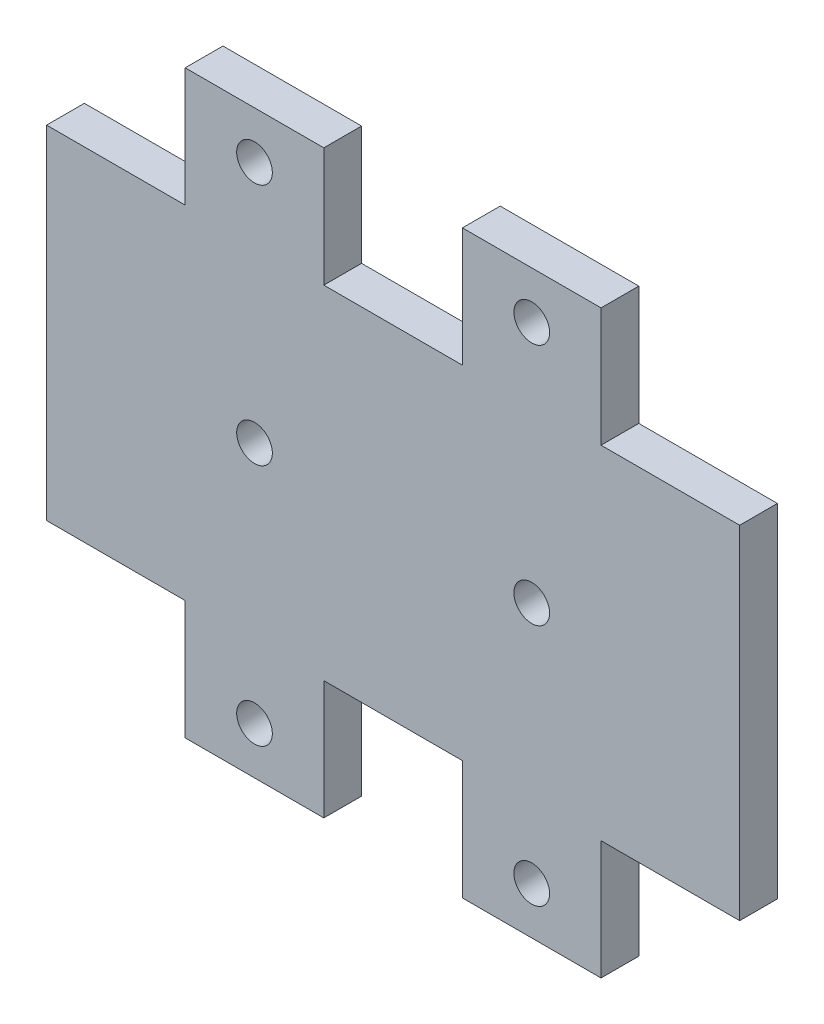
ISO-10303-21;
HEADER;
FILE_DESCRIPTION(('STEP AP214'),'2;1');
FILE_NAME('part.step','',(''),(''),'','','');
FILE_SCHEMA(('AUTOMOTIVE_DESIGN { 1 0 10303 214 1 1 1 1 }'));
ENDSEC;
DATA;
#1=APPLICATION_CONTEXT('core data for automotive mechanical design processes');
#2=APPLICATION_PROTOCOL_DEFINITION('international standard','automotive_design',2000,#1);
#3=PRODUCT_CONTEXT('',#1,'mechanical');
#4=PRODUCT('Part','Part','',(#3));
#5=PRODUCT_RELATED_PRODUCT_CATEGORY('part','',(#4));
#6=PRODUCT_DEFINITION_FORMATION('','',#4);
#7=PRODUCT_DEFINITION_CONTEXT('part definition',#1,'design');
#8=PRODUCT_DEFINITION('design','',#6,#7);
#9=PRODUCT_DEFINITION_SHAPE('','',#8);
#10=(LENGTH_UNIT() NAMED_UNIT(*) SI_UNIT(.MILLI.,.METRE.));
#11=(NAMED_UNIT(*) PLANE_ANGLE_UNIT() SI_UNIT($,.RADIAN.));
#12=(NAMED_UNIT(*) SI_UNIT($,.STERADIAN.) SOLID_ANGLE_UNIT());
#13=UNCERTAINTY_MEASURE_WITH_UNIT(LENGTH_MEASURE(1.E-05),#10,'distance_accuracy_value','');
#14=(GEOMETRIC_REPRESENTATION_CONTEXT(3) GLOBAL_UNCERTAINTY_ASSIGNED_CONTEXT((#13)) GLOBAL_UNIT_ASSIGNED_CONTEXT((#10,
#11,#12)) REPRESENTATION_CONTEXT('',''));
#15=CARTESIAN_POINT('',(0.,0.,0.));
#16=DIRECTION('',(0.,0.,1.));
#17=DIRECTION('',(1.,0.,0.));
#18=AXIS2_PLACEMENT_3D('',#15,#16,#17);
#19=CARTESIAN_POINT('',(17.485,0.,3.175));
#20=DIRECTION('',(0.,0.,1.));
#21=DIRECTION('',(1.,0.,0.));
#22=AXIS2_PLACEMENT_3D('',#19,#20,#21);
#23=PLANE('',#22);
#24=CARTESIAN_POINT('',(17.485,0.,3.175));
#25=DIRECTION('',(0.,0.,-1.));
#26=DIRECTION('',(1.,0.,0.));
#27=AXIS2_PLACEMENT_3D('',#24,#25,#26);
#28=CIRCLE('',#27,1.5);
#29=CARTESIAN_POINT('',(18.985,0.,3.175));
#30=VERTEX_POINT('',#29);
#31=EDGE_CURVE('E407',#30,#30,#28,.T.);
#32=ORIENTED_EDGE('',*,*,#31,.T.);
#33=EDGE_LOOP('',(#32));
#34=FACE_BOUND('',#33,.T.);
#35=DIRECTION('',(-1.,0.,0.));
#36=VECTOR('',#35,1.);
#37=CARTESIAN_POINT('',(0.,14.4,3.175));
#38=LINE('',#37,#36);
#39=CARTESIAN_POINT('',(11.656,14.4,3.175));
#40=VERTEX_POINT('',#39);
#41=CARTESIAN_POINT('',(0.,14.4,3.175));
#42=VERTEX_POINT('',#41);
#43=EDGE_CURVE('E136',#40,#42,#38,.T.);
#44=ORIENTED_EDGE('',*,*,#43,.T.);
#45=DIRECTION('',(0.,-1.,0.));
#46=VECTOR('',#45,1.);
#47=CARTESIAN_POINT('',(0.,0.,3.175));
#48=LINE('',#47,#46);
#49=CARTESIAN_POINT('',(0.,-14.4,3.175));
#50=VERTEX_POINT('',#49);
#51=EDGE_CURVE('E89',#42,#50,#48,.T.);
#52=ORIENTED_EDGE('',*,*,#51,.T.);
#53=DIRECTION('',(-1.,0.,0.));
#54=VECTOR('',#53,1.);
#55=CARTESIAN_POINT('',(0.,-14.4,3.175));
#56=LINE('',#55,#54);
#57=CARTESIAN_POINT('',(11.656,-14.4,3.175));
#58=VERTEX_POINT('',#57);
#59=EDGE_CURVE('E357',#58,#50,#56,.T.);
#60=ORIENTED_EDGE('',*,*,#59,.F.);
#61=DIRECTION('',(0.,1.,0.));
#62=VECTOR('',#61,1.);
#63=CARTESIAN_POINT('',(11.656,-14.4,3.175));
#64=LINE('',#63,#62);
#65=CARTESIAN_POINT('',(11.656,-24.4,3.175));
#66=VERTEX_POINT('',#65);
#67=EDGE_CURVE('E370',#66,#58,#64,.T.);
#68=ORIENTED_EDGE('',*,*,#67,.F.);
#69=DIRECTION('',(-1.,0.,0.));
#70=VECTOR('',#69,1.);
#71=CARTESIAN_POINT('',(11.656,-24.4,3.175));
#72=LINE('',#71,#70);
#73=CARTESIAN_POINT('',(23.312,-24.4,3.175));
#74=VERTEX_POINT('',#73);
#75=EDGE_CURVE('E367',#74,#66,#72,.T.);
#76=ORIENTED_EDGE('',*,*,#75,.F.);
#77=DIRECTION('',(0.,-1.,0.));
#78=VECTOR('',#77,1.);
#79=CARTESIAN_POINT('',(23.312,-14.4,3.175));
#80=LINE('',#79,#78);
#81=CARTESIAN_POINT('',(23.312,-14.4,3.175));
#82=VERTEX_POINT('',#81);
#83=EDGE_CURVE('E364',#82,#74,#80,.T.);
#84=ORIENTED_EDGE('',*,*,#83,.F.);
#85=DIRECTION('',(-1.,0.,0.));
#86=VECTOR('',#85,1.);
#87=CARTESIAN_POINT('',(23.312,-14.4,3.175));
#88=LINE('',#87,#86);
#89=CARTESIAN_POINT('',(34.968,-14.4,3.175));
#90=VERTEX_POINT('',#89);
#91=EDGE_CURVE('E360',#90,#82,#88,.T.);
#92=ORIENTED_EDGE('',*,*,#91,.F.);
#93=DIRECTION('',(0.,-1.,0.));
#94=VECTOR('',#93,1.);
#95=CARTESIAN_POINT('',(34.968,-14.4,3.175));
#96=LINE('',#95,#94);
#97=CARTESIAN_POINT('',(34.968,-24.4,3.175));
#98=VERTEX_POINT('',#97);
#99=EDGE_CURVE('E260',#90,#98,#96,.T.);
#100=ORIENTED_EDGE('',*,*,#99,.T.);
#101=DIRECTION('',(1.,0.,0.));
#102=VECTOR('',#101,1.);
#103=CARTESIAN_POINT('',(46.624,-24.4,3.175));
#104=LINE('',#103,#102);
#105=CARTESIAN_POINT('',(46.624,-24.4,3.175));
#106=VERTEX_POINT('',#105);
#107=EDGE_CURVE('E264',#98,#106,#104,.T.);
#108=ORIENTED_EDGE('',*,*,#107,.T.);
#109=DIRECTION('',(0.,1.,0.));
#110=VECTOR('',#109,1.);
#111=CARTESIAN_POINT('',(46.624,-14.4,3.175));
#112=LINE('',#111,#110);
#113=CARTESIAN_POINT('',(46.624,-14.4,3.175));
#114=VERTEX_POINT('',#113);
#115=EDGE_CURVE('E267',#106,#114,#112,.T.);
#116=ORIENTED_EDGE('',*,*,#115,.T.);
#117=DIRECTION('',(1.,0.,0.));
#118=VECTOR('',#117,1.);
#119=CARTESIAN_POINT('',(58.28,-14.4,3.175));
#120=LINE('',#119,#118);
#121=CARTESIAN_POINT('',(58.28,-14.4,3.175));
#122=VERTEX_POINT('',#121);
#123=EDGE_CURVE('E257',#114,#122,#120,.T.);
#124=ORIENTED_EDGE('',*,*,#123,.T.);
#125=DIRECTION('',(0.,-1.,0.));
#126=VECTOR('',#125,1.);
#127=CARTESIAN_POINT('',(58.28,0.,3.175));
#128=LINE('',#127,#126);
#129=CARTESIAN_POINT('',(58.28,14.4,3.175));
#130=VERTEX_POINT('',#129);
#131=EDGE_CURVE('E305',#130,#122,#128,.T.);
#132=ORIENTED_EDGE('',*,*,#131,.F.);
#133=DIRECTION('',(1.,0.,0.));
#134=VECTOR('',#133,1.);
#135=CARTESIAN_POINT('',(58.28,14.4,3.175));
#136=LINE('',#135,#134);
#137=CARTESIAN_POINT('',(46.624,14.4,3.175));
#138=VERTEX_POINT('',#137);
#139=EDGE_CURVE('E302',#138,#130,#136,.T.);
#140=ORIENTED_EDGE('',*,*,#139,.F.);
#141=DIRECTION('',(0.,-1.,0.));
#142=VECTOR('',#141,1.);
#143=CARTESIAN_POINT('',(46.624,14.4,3.175));
#144=LINE('',#143,#142);
#145=CARTESIAN_POINT('',(46.624,24.4,3.175));
#146=VERTEX_POINT('',#145);
#147=EDGE_CURVE('E318',#146,#138,#144,.T.);
#148=ORIENTED_EDGE('',*,*,#147,.F.);
#149=DIRECTION('',(1.,0.,0.));
#150=VECTOR('',#149,1.);
#151=CARTESIAN_POINT('',(46.624,24.4,3.175));
#152=LINE('',#151,#150);
#153=CARTESIAN_POINT('',(34.968,24.4,3.175));
#154=VERTEX_POINT('',#153);
#155=EDGE_CURVE('E315',#154,#146,#152,.T.);
#156=ORIENTED_EDGE('',*,*,#155,.F.);
#157=DIRECTION('',(0.,1.,0.));
#158=VECTOR('',#157,1.);
#159=CARTESIAN_POINT('',(34.968,14.4,3.175));
#160=LINE('',#159,#158);
#161=CARTESIAN_POINT('',(34.968,14.4,3.175));
#162=VERTEX_POINT('',#161);
#163=EDGE_CURVE('E312',#162,#154,#160,.T.);
#164=ORIENTED_EDGE('',*,*,#163,.F.);
#165=DIRECTION('',(-1.,0.,0.));
#166=VECTOR('',#165,1.);
#167=CARTESIAN_POINT('',(23.312,14.4,3.175));
#168=LINE('',#167,#166);
#169=CARTESIAN_POINT('',(23.312,14.4,3.175));
#170=VERTEX_POINT('',#169);
#171=EDGE_CURVE('E104',#162,#170,#168,.T.);
#172=ORIENTED_EDGE('',*,*,#171,.T.);
#173=DIRECTION('',(0.,1.,0.));
#174=VECTOR('',#173,1.);
#175=CARTESIAN_POINT('',(23.312,14.4,3.175));
#176=LINE('',#175,#174);
#177=CARTESIAN_POINT('',(23.312,24.4,3.175));
#178=VERTEX_POINT('',#177);
#179=EDGE_CURVE('E97',#170,#178,#176,.T.);
#180=ORIENTED_EDGE('',*,*,#179,.T.);
#181=DIRECTION('',(-1.,0.,0.));
#182=VECTOR('',#181,1.);
#183=CARTESIAN_POINT('',(11.656,24.4,3.175));
#184=LINE('',#183,#182);
#185=CARTESIAN_POINT('',(11.656,24.4,3.175));
#186=VERTEX_POINT('',#185);
#187=EDGE_CURVE('E101',#178,#186,#184,.T.);
#188=ORIENTED_EDGE('',*,*,#187,.T.);
#189=DIRECTION('',(0.,-1.,0.));
#190=VECTOR('',#189,1.);
#191=CARTESIAN_POINT('',(11.656,14.4,3.175));
#192=LINE('',#191,#190);
#193=EDGE_CURVE('E54',#186,#40,#192,.T.);
#194=ORIENTED_EDGE('',*,*,#193,.T.);
#195=EDGE_LOOP('',(#44,#52,#60,#68,#76,#84,#92,#100,#108,#116,#124,#132,#140,#148,#156,#164,
#172,#180,#188,#194));
#196=FACE_BOUND('',#195,.T.);
#197=CARTESIAN_POINT('',(17.484,20.43125,3.175));
#198=DIRECTION('',(0.,0.,1.));
#199=DIRECTION('',(1.,0.,0.));
#200=AXIS2_PLACEMENT_3D('',#197,#198,#199);
#201=CIRCLE('',#200,1.5);
#202=CARTESIAN_POINT('',(18.984,20.43125,3.175));
#203=VERTEX_POINT('',#202);
#204=EDGE_CURVE('E125',#203,#203,#201,.T.);
#205=ORIENTED_EDGE('',*,*,#204,.F.);
#206=EDGE_LOOP('',(#205));
#207=FACE_BOUND('',#206,.T.);
#208=CARTESIAN_POINT('',(17.484,-20.43125,3.175));
#209=DIRECTION('',(0.,0.,-1.));
#210=DIRECTION('',(1.,0.,0.));
#211=AXIS2_PLACEMENT_3D('',#208,#209,#210);
#212=CIRCLE('',#211,1.5);
#213=CARTESIAN_POINT('',(18.984,-20.43125,3.175));
#214=VERTEX_POINT('',#213);
#215=EDGE_CURVE('E351',#214,#214,#212,.T.);
#216=ORIENTED_EDGE('',*,*,#215,.T.);
#217=EDGE_LOOP('',(#216));
#218=FACE_BOUND('',#217,.T.);
#219=CARTESIAN_POINT('',(40.795,0.,3.175));
#220=DIRECTION('',(0.,0.,1.));
#221=DIRECTION('',(-1.,0.,0.));
#222=AXIS2_PLACEMENT_3D('',#219,#220,#221);
#223=CIRCLE('',#222,1.5);
#224=CARTESIAN_POINT('',(39.295,0.,3.175));
#225=VERTEX_POINT('',#224);
#226=EDGE_CURVE('E309',#225,#225,#223,.T.);
#227=ORIENTED_EDGE('',*,*,#226,.F.);
#228=EDGE_LOOP('',(#227));
#229=FACE_BOUND('',#228,.T.);
#230=CARTESIAN_POINT('',(40.796,20.43125,3.175));
#231=DIRECTION('',(0.,0.,-1.));
#232=DIRECTION('',(-1.,0.,0.));
#233=AXIS2_PLACEMENT_3D('',#230,#231,#232);
#234=CIRCLE('',#233,1.5);
#235=CARTESIAN_POINT('',(39.296,20.43125,3.175));
#236=VERTEX_POINT('',#235);
#237=EDGE_CURVE('E296',#236,#236,#234,.T.);
#238=ORIENTED_EDGE('',*,*,#237,.T.);
#239=EDGE_LOOP('',(#238));
#240=FACE_BOUND('',#239,.T.);
#241=CARTESIAN_POINT('',(40.796,-20.43125,3.175));
#242=DIRECTION('',(0.,0.,1.));
#243=DIRECTION('',(-1.,0.,0.));
#244=AXIS2_PLACEMENT_3D('',#241,#242,#243);
#245=CIRCLE('',#244,1.5);
#246=CARTESIAN_POINT('',(39.296,-20.43125,3.175));
#247=VERTEX_POINT('',#246);
#248=EDGE_CURVE('E248',#247,#247,#245,.T.);
#249=ORIENTED_EDGE('',*,*,#248,.F.);
#250=EDGE_LOOP('',(#249));
#251=FACE_BOUND('',#250,.T.);
#252=ADVANCED_FACE('F37',(#34,#196,#207,#218,#229,#240,#251),#23,.T.);
#253=CARTESIAN_POINT('',(17.485,0.,0.));
#254=DIRECTION('',(0.,0.,1.));
#255=DIRECTION('',(1.,0.,0.));
#256=AXIS2_PLACEMENT_3D('',#253,#254,#255);
#257=PLANE('',#256);
#258=CARTESIAN_POINT('',(17.485,0.,0.));
#259=DIRECTION('',(0.,0.,-1.));
#260=DIRECTION('',(1.,0.,0.));
#261=AXIS2_PLACEMENT_3D('',#258,#259,#260);
#262=CIRCLE('',#261,1.5);
#263=CARTESIAN_POINT('',(18.985,0.,0.));
#264=VERTEX_POINT('',#263);
#265=EDGE_CURVE('E128',#264,#264,#262,.T.);
#266=ORIENTED_EDGE('',*,*,#265,.F.);
#267=EDGE_LOOP('',(#266));
#268=FACE_BOUND('',#267,.T.);
#269=DIRECTION('',(-1.,0.,0.));
#270=VECTOR('',#269,1.);
#271=CARTESIAN_POINT('',(0.,14.4,0.));
#272=LINE('',#271,#270);
#273=CARTESIAN_POINT('',(11.656,14.4,0.));
#274=VERTEX_POINT('',#273);
#275=CARTESIAN_POINT('',(0.,14.4,0.));
#276=VERTEX_POINT('',#275);
#277=EDGE_CURVE('E121',#274,#276,#272,.T.);
#278=ORIENTED_EDGE('',*,*,#277,.F.);
#279=DIRECTION('',(0.,-1.,0.));
#280=VECTOR('',#279,1.);
#281=CARTESIAN_POINT('',(11.656,14.4,0.));
#282=LINE('',#281,#280);
#283=CARTESIAN_POINT('',(11.656,24.4,0.));
#284=VERTEX_POINT('',#283);
#285=EDGE_CURVE('E81',#284,#274,#282,.T.);
#286=ORIENTED_EDGE('',*,*,#285,.F.);
#287=DIRECTION('',(-1.,0.,0.));
#288=VECTOR('',#287,1.);
#289=CARTESIAN_POINT('',(11.656,24.4,0.));
#290=LINE('',#289,#288);
#291=CARTESIAN_POINT('',(23.312,24.4,0.));
#292=VERTEX_POINT('',#291);
#293=EDGE_CURVE('E75',#292,#284,#290,.T.);
#294=ORIENTED_EDGE('',*,*,#293,.F.);
#295=DIRECTION('',(0.,1.,0.));
#296=VECTOR('',#295,1.);
#297=CARTESIAN_POINT('',(23.312,14.4,0.));
#298=LINE('',#297,#296);
#299=CARTESIAN_POINT('',(23.312,14.4,0.));
#300=VERTEX_POINT('',#299);
#301=EDGE_CURVE('E112',#300,#292,#298,.T.);
#302=ORIENTED_EDGE('',*,*,#301,.F.);
#303=DIRECTION('',(-1.,0.,0.));
#304=VECTOR('',#303,1.);
#305=CARTESIAN_POINT('',(23.312,14.4,0.));
#306=LINE('',#305,#304);
#307=CARTESIAN_POINT('',(34.968,14.4,0.));
#308=VERTEX_POINT('',#307);
#309=EDGE_CURVE('E131',#308,#300,#306,.T.);
#310=ORIENTED_EDGE('',*,*,#309,.F.);
#311=DIRECTION('',(0.,1.,0.));
#312=VECTOR('',#311,1.);
#313=CARTESIAN_POINT('',(34.968,14.4,0.));
#314=LINE('',#313,#312);
#315=CARTESIAN_POINT('',(34.968,24.4,0.));
#316=VERTEX_POINT('',#315);
#317=EDGE_CURVE('E330',#308,#316,#314,.T.);
#318=ORIENTED_EDGE('',*,*,#317,.T.);
#319=DIRECTION('',(1.,0.,0.));
#320=VECTOR('',#319,1.);
#321=CARTESIAN_POINT('',(46.624,24.4,0.));
#322=LINE('',#321,#320);
#323=CARTESIAN_POINT('',(46.624,24.4,0.));
#324=VERTEX_POINT('',#323);
#325=EDGE_CURVE('E332',#316,#324,#322,.T.);
#326=ORIENTED_EDGE('',*,*,#325,.T.);
#327=DIRECTION('',(0.,-1.,0.));
#328=VECTOR('',#327,1.);
#329=CARTESIAN_POINT('',(46.624,14.4,0.));
#330=LINE('',#329,#328);
#331=CARTESIAN_POINT('',(46.624,14.4,0.));
#332=VERTEX_POINT('',#331);
#333=EDGE_CURVE('E306',#324,#332,#330,.T.);
#334=ORIENTED_EDGE('',*,*,#333,.T.);
#335=DIRECTION('',(1.,0.,0.));
#336=VECTOR('',#335,1.);
#337=CARTESIAN_POINT('',(58.28,14.4,0.));
#338=LINE('',#337,#336);
#339=CARTESIAN_POINT('',(58.28,14.4,0.));
#340=VERTEX_POINT('',#339);
#341=EDGE_CURVE('E299',#332,#340,#338,.T.);
#342=ORIENTED_EDGE('',*,*,#341,.T.);
#343=DIRECTION('',(0.,-1.,0.));
#344=VECTOR('',#343,1.);
#345=CARTESIAN_POINT('',(58.28,0.,0.));
#346=LINE('',#345,#344);
#347=CARTESIAN_POINT('',(58.28,-14.4,0.));
#348=VERTEX_POINT('',#347);
#349=EDGE_CURVE('E324',#340,#348,#346,.T.);
#350=ORIENTED_EDGE('',*,*,#349,.T.);
#351=DIRECTION('',(1.,0.,0.));
#352=VECTOR('',#351,1.);
#353=CARTESIAN_POINT('',(58.28,-14.4,0.));
#354=LINE('',#353,#352);
#355=CARTESIAN_POINT('',(46.624,-14.4,0.));
#356=VERTEX_POINT('',#355);
#357=EDGE_CURVE('E254',#356,#348,#354,.T.);
#358=ORIENTED_EDGE('',*,*,#357,.F.);
#359=DIRECTION('',(0.,1.,0.));
#360=VECTOR('',#359,1.);
#361=CARTESIAN_POINT('',(46.624,-14.4,0.));
#362=LINE('',#361,#360);
#363=CARTESIAN_POINT('',(46.624,-24.4,0.));
#364=VERTEX_POINT('',#363);
#365=EDGE_CURVE('E261',#364,#356,#362,.T.);
#366=ORIENTED_EDGE('',*,*,#365,.F.);
#367=DIRECTION('',(1.,0.,0.));
#368=VECTOR('',#367,1.);
#369=CARTESIAN_POINT('',(46.624,-24.4,0.));
#370=LINE('',#369,#368);
#371=CARTESIAN_POINT('',(34.968,-24.4,0.));
#372=VERTEX_POINT('',#371);
#373=EDGE_CURVE('E276',#372,#364,#370,.T.);
#374=ORIENTED_EDGE('',*,*,#373,.F.);
#375=DIRECTION('',(0.,-1.,0.));
#376=VECTOR('',#375,1.);
#377=CARTESIAN_POINT('',(34.968,-14.4,0.));
#378=LINE('',#377,#376);
#379=CARTESIAN_POINT('',(34.968,-14.4,0.));
#380=VERTEX_POINT('',#379);
#381=EDGE_CURVE('E273',#380,#372,#378,.T.);
#382=ORIENTED_EDGE('',*,*,#381,.F.);
#383=DIRECTION('',(-1.,0.,0.));
#384=VECTOR('',#383,1.);
#385=CARTESIAN_POINT('',(23.312,-14.4,0.));
#386=LINE('',#385,#384);
#387=CARTESIAN_POINT('',(23.312,-14.4,0.));
#388=VERTEX_POINT('',#387);
#389=EDGE_CURVE('E375',#380,#388,#386,.T.);
#390=ORIENTED_EDGE('',*,*,#389,.T.);
#391=DIRECTION('',(0.,-1.,0.));
#392=VECTOR('',#391,1.);
#393=CARTESIAN_POINT('',(23.312,-14.4,0.));
#394=LINE('',#393,#392);
#395=CARTESIAN_POINT('',(23.312,-24.4,0.));
#396=VERTEX_POINT('',#395);
#397=EDGE_CURVE('E378',#388,#396,#394,.T.);
#398=ORIENTED_EDGE('',*,*,#397,.T.);
#399=DIRECTION('',(-1.,0.,0.));
#400=VECTOR('',#399,1.);
#401=CARTESIAN_POINT('',(11.656,-24.4,0.));
#402=LINE('',#401,#400);
#403=CARTESIAN_POINT('',(11.656,-24.4,0.));
#404=VERTEX_POINT('',#403);
#405=EDGE_CURVE('E381',#396,#404,#402,.T.);
#406=ORIENTED_EDGE('',*,*,#405,.T.);
#407=DIRECTION('',(0.,1.,0.));
#408=VECTOR('',#407,1.);
#409=CARTESIAN_POINT('',(11.656,-14.4,0.));
#410=LINE('',#409,#408);
#411=CARTESIAN_POINT('',(11.656,-14.4,0.));
#412=VERTEX_POINT('',#411);
#413=EDGE_CURVE('E361',#404,#412,#410,.T.);
#414=ORIENTED_EDGE('',*,*,#413,.T.);
#415=DIRECTION('',(-1.,0.,0.));
#416=VECTOR('',#415,1.);
#417=CARTESIAN_POINT('',(0.,-14.4,0.));
#418=LINE('',#417,#416);
#419=CARTESIAN_POINT('',(0.,-14.4,0.));
#420=VERTEX_POINT('',#419);
#421=EDGE_CURVE('E354',#412,#420,#418,.T.);
#422=ORIENTED_EDGE('',*,*,#421,.T.);
#423=DIRECTION('',(0.,-1.,0.));
#424=VECTOR('',#423,1.);
#425=CARTESIAN_POINT('',(0.,0.,0.));
#426=LINE('',#425,#424);
#427=EDGE_CURVE('E124',#276,#420,#426,.T.);
#428=ORIENTED_EDGE('',*,*,#427,.F.);
#429=EDGE_LOOP('',(#278,#286,#294,#302,#310,#318,#326,#334,#342,#350,#358,#366,#374,#382,#390,
#398,#406,#414,#422,#428));
#430=FACE_BOUND('',#429,.T.);
#431=CARTESIAN_POINT('',(17.484,20.43125,0.));
#432=DIRECTION('',(0.,0.,1.));
#433=DIRECTION('',(1.,0.,0.));
#434=AXIS2_PLACEMENT_3D('',#431,#432,#433);
#435=CIRCLE('',#434,1.5);
#436=CARTESIAN_POINT('',(18.984,20.43125,0.));
#437=VERTEX_POINT('',#436);
#438=EDGE_CURVE('E400',#437,#437,#435,.T.);
#439=ORIENTED_EDGE('',*,*,#438,.T.);
#440=EDGE_LOOP('',(#439));
#441=FACE_BOUND('',#440,.T.);
#442=CARTESIAN_POINT('',(17.484,-20.43125,0.));
#443=DIRECTION('',(0.,0.,-1.));
#444=DIRECTION('',(1.,0.,0.));
#445=AXIS2_PLACEMENT_3D('',#442,#443,#444);
#446=CIRCLE('',#445,1.5);
#447=CARTESIAN_POINT('',(18.984,-20.43125,0.));
#448=VERTEX_POINT('',#447);
#449=EDGE_CURVE('E350',#448,#448,#446,.T.);
#450=ORIENTED_EDGE('',*,*,#449,.F.);
#451=EDGE_LOOP('',(#450));
#452=FACE_BOUND('',#451,.T.);
#453=CARTESIAN_POINT('',(40.795,0.,0.));
#454=DIRECTION('',(0.,0.,1.));
#455=DIRECTION('',(-1.,0.,0.));
#456=AXIS2_PLACEMENT_3D('',#453,#454,#455);
#457=CIRCLE('',#456,1.5);
#458=CARTESIAN_POINT('',(39.295,0.,0.));
#459=VERTEX_POINT('',#458);
#460=EDGE_CURVE('E327',#459,#459,#457,.T.);
#461=ORIENTED_EDGE('',*,*,#460,.T.);
#462=EDGE_LOOP('',(#461));
#463=FACE_BOUND('',#462,.T.);
#464=CARTESIAN_POINT('',(40.796,20.43125,0.));
#465=DIRECTION('',(0.,0.,-1.));
#466=DIRECTION('',(-1.,0.,0.));
#467=AXIS2_PLACEMENT_3D('',#464,#465,#466);
#468=CIRCLE('',#467,1.5);
#469=CARTESIAN_POINT('',(39.296,20.43125,0.));
#470=VERTEX_POINT('',#469);
#471=EDGE_CURVE('E295',#470,#470,#468,.T.);
#472=ORIENTED_EDGE('',*,*,#471,.F.);
#473=EDGE_LOOP('',(#472));
#474=FACE_BOUND('',#473,.T.);
#475=CARTESIAN_POINT('',(40.796,-20.43125,0.));
#476=DIRECTION('',(0.,0.,1.));
#477=DIRECTION('',(-1.,0.,0.));
#478=AXIS2_PLACEMENT_3D('',#475,#476,#477);
#479=CIRCLE('',#478,1.5);
#480=CARTESIAN_POINT('',(39.296,-20.43125,0.));
#481=VERTEX_POINT('',#480);
#482=EDGE_CURVE('E251',#481,#481,#479,.T.);
#483=ORIENTED_EDGE('',*,*,#482,.T.);
#484=EDGE_LOOP('',(#483));
#485=FACE_BOUND('',#484,.T.);
#486=ADVANCED_FACE('F142',(#268,#430,#441,#452,#463,#474,#485),#257,.F.);
#487=CARTESIAN_POINT('',(0.,14.4,3.175));
#488=DIRECTION('',(0.,-1.,0.));
#489=DIRECTION('',(1.,0.,0.));
#490=AXIS2_PLACEMENT_3D('',#487,#488,#489);
#491=PLANE('',#490);
#492=ORIENTED_EDGE('',*,*,#277,.T.);
#493=DIRECTION('',(0.,0.,-1.));
#494=VECTOR('',#493,1.);
#495=CARTESIAN_POINT('',(0.,14.4,3.175));
#496=LINE('',#495,#494);
#497=EDGE_CURVE('E11',#42,#276,#496,.T.);
#498=ORIENTED_EDGE('',*,*,#497,.F.);
#499=ORIENTED_EDGE('',*,*,#43,.F.);
#500=DIRECTION('',(0.,0.,-1.));
#501=VECTOR('',#500,1.);
#502=CARTESIAN_POINT('',(11.656,14.4,3.175));
#503=LINE('',#502,#501);
#504=EDGE_CURVE('E117',#40,#274,#503,.T.);
#505=ORIENTED_EDGE('',*,*,#504,.T.);
#506=EDGE_LOOP('',(#492,#498,#499,#505));
#507=FACE_BOUND('',#506,.T.);
#508=ADVANCED_FACE('F39',(#507),#491,.F.);
#509=CARTESIAN_POINT('',(0.,0.,3.175));
#510=DIRECTION('',(1.,0.,0.));
#511=DIRECTION('',(0.,0.,-1.));
#512=AXIS2_PLACEMENT_3D('',#509,#510,#511);
#513=PLANE('',#512);
#514=ORIENTED_EDGE('',*,*,#427,.T.);
#515=DIRECTION('',(0.,0.,-1.));
#516=VECTOR('',#515,1.);
#517=CARTESIAN_POINT('',(0.,-14.4,3.175));
#518=LINE('',#517,#516);
#519=EDGE_CURVE('E397',#50,#420,#518,.T.);
#520=ORIENTED_EDGE('',*,*,#519,.F.);
#521=ORIENTED_EDGE('',*,*,#51,.F.);
#522=ORIENTED_EDGE('',*,*,#497,.T.);
#523=EDGE_LOOP('',(#514,#520,#521,#522));
#524=FACE_BOUND('',#523,.T.);
#525=ADVANCED_FACE('F413',(#524),#513,.F.);
#526=CARTESIAN_POINT('',(17.485,0.,3.175));
#527=DIRECTION('',(0.,0.,-1.));
#528=DIRECTION('',(-1.,0.,0.));
#529=AXIS2_PLACEMENT_3D('',#526,#527,#528);
#530=CYLINDRICAL_SURFACE('',#529,1.5);
#531=ORIENTED_EDGE('',*,*,#265,.T.);
#532=EDGE_LOOP('',(#531));
#533=FACE_BOUND('',#532,.T.);
#534=ORIENTED_EDGE('',*,*,#31,.F.);
#535=EDGE_LOOP('',(#534));
#536=FACE_BOUND('',#535,.T.);
#537=ADVANCED_FACE('F410',(#533,#536),#530,.F.);
#538=CARTESIAN_POINT('',(23.312,14.4,3.175));
#539=DIRECTION('',(0.,-1.,0.));
#540=DIRECTION('',(0.,0.,-1.));
#541=AXIS2_PLACEMENT_3D('',#538,#539,#540);
#542=PLANE('',#541);
#543=ORIENTED_EDGE('',*,*,#309,.T.);
#544=DIRECTION('',(0.,0.,-1.));
#545=VECTOR('',#544,1.);
#546=CARTESIAN_POINT('',(23.312,14.4,3.175));
#547=LINE('',#546,#545);
#548=EDGE_CURVE('E46',#170,#300,#547,.T.);
#549=ORIENTED_EDGE('',*,*,#548,.F.);
#550=ORIENTED_EDGE('',*,*,#171,.F.);
#551=DIRECTION('',(0.,0.,-1.));
#552=VECTOR('',#551,1.);
#553=CARTESIAN_POINT('',(34.968,14.4,3.175));
#554=LINE('',#553,#552);
#555=EDGE_CURVE('E345',#162,#308,#554,.T.);
#556=ORIENTED_EDGE('',*,*,#555,.T.);
#557=EDGE_LOOP('',(#543,#549,#550,#556));
#558=FACE_BOUND('',#557,.T.);
#559=ADVANCED_FACE('F412',(#558),#542,.F.);
#560=CARTESIAN_POINT('',(23.312,14.4,3.175));
#561=DIRECTION('',(-1.,0.,0.));
#562=DIRECTION('',(0.,0.,1.));
#563=AXIS2_PLACEMENT_3D('',#560,#561,#562);
#564=PLANE('',#563);
#565=ORIENTED_EDGE('',*,*,#301,.T.);
#566=DIRECTION('',(0.,0.,-1.));
#567=VECTOR('',#566,1.);
#568=CARTESIAN_POINT('',(23.312,24.4,3.175));
#569=LINE('',#568,#567);
#570=EDGE_CURVE('E109',#178,#292,#569,.T.);
#571=ORIENTED_EDGE('',*,*,#570,.F.);
#572=ORIENTED_EDGE('',*,*,#179,.F.);
#573=ORIENTED_EDGE('',*,*,#548,.T.);
#574=EDGE_LOOP('',(#565,#571,#572,#573));
#575=FACE_BOUND('',#574,.T.);
#576=ADVANCED_FACE('F110',(#575),#564,.F.);
#577=CARTESIAN_POINT('',(11.656,24.4,3.175));
#578=DIRECTION('',(0.,-1.,0.));
#579=DIRECTION('',(0.,0.,-1.));
#580=AXIS2_PLACEMENT_3D('',#577,#578,#579);
#581=PLANE('',#580);
#582=ORIENTED_EDGE('',*,*,#293,.T.);
#583=DIRECTION('',(0.,0.,-1.));
#584=VECTOR('',#583,1.);
#585=CARTESIAN_POINT('',(11.656,24.4,3.175));
#586=LINE('',#585,#584);
#587=EDGE_CURVE('E113',#186,#284,#586,.T.);
#588=ORIENTED_EDGE('',*,*,#587,.F.);
#589=ORIENTED_EDGE('',*,*,#187,.F.);
#590=ORIENTED_EDGE('',*,*,#570,.T.);
#591=EDGE_LOOP('',(#582,#588,#589,#590));
#592=FACE_BOUND('',#591,.T.);
#593=ADVANCED_FACE('F115',(#592),#581,.F.);
#594=CARTESIAN_POINT('',(11.656,14.4,3.175));
#595=DIRECTION('',(1.,0.,0.));
#596=DIRECTION('',(0.,0.,-1.));
#597=AXIS2_PLACEMENT_3D('',#594,#595,#596);
#598=PLANE('',#597);
#599=ORIENTED_EDGE('',*,*,#285,.T.);
#600=ORIENTED_EDGE('',*,*,#504,.F.);
#601=ORIENTED_EDGE('',*,*,#193,.F.);
#602=ORIENTED_EDGE('',*,*,#587,.T.);
#603=EDGE_LOOP('',(#599,#600,#601,#602));
#604=FACE_BOUND('',#603,.T.);
#605=ADVANCED_FACE('F151',(#604),#598,.F.);
#606=CARTESIAN_POINT('',(17.484,20.43125,3.175));
#607=DIRECTION('',(0.,0.,-1.));
#608=DIRECTION('',(-1.,0.,0.));
#609=AXIS2_PLACEMENT_3D('',#606,#607,#608);
#610=CYLINDRICAL_SURFACE('',#609,1.5);
#611=ORIENTED_EDGE('',*,*,#204,.T.);
#612=EDGE_LOOP('',(#611));
#613=FACE_BOUND('',#612,.T.);
#614=ORIENTED_EDGE('',*,*,#438,.F.);
#615=EDGE_LOOP('',(#614));
#616=FACE_BOUND('',#615,.T.);
#617=ADVANCED_FACE('F153',(#613,#616),#610,.F.);
#618=CARTESIAN_POINT('',(0.,-14.4,3.175));
#619=DIRECTION('',(0.,1.,0.));
#620=DIRECTION('',(1.,0.,0.));
#621=AXIS2_PLACEMENT_3D('',#618,#619,#620);
#622=PLANE('',#621);
#623=ORIENTED_EDGE('',*,*,#421,.F.);
#624=DIRECTION('',(0.,0.,-1.));
#625=VECTOR('',#624,1.);
#626=CARTESIAN_POINT('',(11.656,-14.4,3.175));
#627=LINE('',#626,#625);
#628=EDGE_CURVE('E373',#58,#412,#627,.T.);
#629=ORIENTED_EDGE('',*,*,#628,.F.);
#630=ORIENTED_EDGE('',*,*,#59,.T.);
#631=ORIENTED_EDGE('',*,*,#519,.T.);
#632=EDGE_LOOP('',(#623,#629,#630,#631));
#633=FACE_BOUND('',#632,.T.);
#634=ADVANCED_FACE('F159',(#633),#622,.F.);
#635=CARTESIAN_POINT('',(23.312,-14.4,3.175));
#636=DIRECTION('',(0.,1.,0.));
#637=DIRECTION('',(0.,0.,-1.));
#638=AXIS2_PLACEMENT_3D('',#635,#636,#637);
#639=PLANE('',#638);
#640=ORIENTED_EDGE('',*,*,#389,.F.);
#641=DIRECTION('',(0.,0.,-1.));
#642=VECTOR('',#641,1.);
#643=CARTESIAN_POINT('',(34.968,-14.4,3.175));
#644=LINE('',#643,#642);
#645=EDGE_CURVE('E289',#90,#380,#644,.T.);
#646=ORIENTED_EDGE('',*,*,#645,.F.);
#647=ORIENTED_EDGE('',*,*,#91,.T.);
#648=DIRECTION('',(0.,0.,-1.));
#649=VECTOR('',#648,1.);
#650=CARTESIAN_POINT('',(23.312,-14.4,3.175));
#651=LINE('',#650,#649);
#652=EDGE_CURVE('E394',#82,#388,#651,.T.);
#653=ORIENTED_EDGE('',*,*,#652,.T.);
#654=EDGE_LOOP('',(#640,#646,#647,#653));
#655=FACE_BOUND('',#654,.T.);
#656=ADVANCED_FACE('F175',(#655),#639,.F.);
#657=CARTESIAN_POINT('',(23.312,-14.4,3.175));
#658=DIRECTION('',(-1.,0.,0.));
#659=DIRECTION('',(0.,0.,1.));
#660=AXIS2_PLACEMENT_3D('',#657,#658,#659);
#661=PLANE('',#660);
#662=ORIENTED_EDGE('',*,*,#397,.F.);
#663=ORIENTED_EDGE('',*,*,#652,.F.);
#664=ORIENTED_EDGE('',*,*,#83,.T.);
#665=DIRECTION('',(0.,0.,-1.));
#666=VECTOR('',#665,1.);
#667=CARTESIAN_POINT('',(23.312,-24.4,3.175));
#668=LINE('',#667,#666);
#669=EDGE_CURVE('E391',#74,#396,#668,.T.);
#670=ORIENTED_EDGE('',*,*,#669,.T.);
#671=EDGE_LOOP('',(#662,#663,#664,#670));
#672=FACE_BOUND('',#671,.T.);
#673=ADVANCED_FACE('F179',(#672),#661,.F.);
#674=CARTESIAN_POINT('',(11.656,-24.4,3.175));
#675=DIRECTION('',(0.,1.,0.));
#676=DIRECTION('',(0.,0.,-1.));
#677=AXIS2_PLACEMENT_3D('',#674,#675,#676);
#678=PLANE('',#677);
#679=ORIENTED_EDGE('',*,*,#405,.F.);
#680=ORIENTED_EDGE('',*,*,#669,.F.);
#681=ORIENTED_EDGE('',*,*,#75,.T.);
#682=DIRECTION('',(0.,0.,-1.));
#683=VECTOR('',#682,1.);
#684=CARTESIAN_POINT('',(11.656,-24.4,3.175));
#685=LINE('',#684,#683);
#686=EDGE_CURVE('E388',#66,#404,#685,.T.);
#687=ORIENTED_EDGE('',*,*,#686,.T.);
#688=EDGE_LOOP('',(#679,#680,#681,#687));
#689=FACE_BOUND('',#688,.T.);
#690=ADVANCED_FACE('F183',(#689),#678,.F.);
#691=CARTESIAN_POINT('',(11.656,-14.4,3.175));
#692=DIRECTION('',(1.,0.,0.));
#693=DIRECTION('',(0.,0.,-1.));
#694=AXIS2_PLACEMENT_3D('',#691,#692,#693);
#695=PLANE('',#694);
#696=ORIENTED_EDGE('',*,*,#413,.F.);
#697=ORIENTED_EDGE('',*,*,#686,.F.);
#698=ORIENTED_EDGE('',*,*,#67,.T.);
#699=ORIENTED_EDGE('',*,*,#628,.T.);
#700=EDGE_LOOP('',(#696,#697,#698,#699));
#701=FACE_BOUND('',#700,.T.);
#702=ADVANCED_FACE('F187',(#701),#695,.F.);
#703=CARTESIAN_POINT('',(17.484,-20.43125,3.175));
#704=DIRECTION('',(0.,0.,-1.));
#705=DIRECTION('',(-1.,0.,0.));
#706=AXIS2_PLACEMENT_3D('',#703,#704,#705);
#707=CYLINDRICAL_SURFACE('',#706,1.5);
#708=ORIENTED_EDGE('',*,*,#215,.F.);
#709=EDGE_LOOP('',(#708));
#710=FACE_BOUND('',#709,.T.);
#711=ORIENTED_EDGE('',*,*,#449,.T.);
#712=EDGE_LOOP('',(#711));
#713=FACE_BOUND('',#712,.T.);
#714=ADVANCED_FACE('F191',(#710,#713),#707,.F.);
#715=CARTESIAN_POINT('',(58.28,14.4,3.175));
#716=DIRECTION('',(0.,-1.,0.));
#717=DIRECTION('',(-1.,0.,0.));
#718=AXIS2_PLACEMENT_3D('',#715,#716,#717);
#719=PLANE('',#718);
#720=ORIENTED_EDGE('',*,*,#341,.F.);
#721=DIRECTION('',(0.,0.,-1.));
#722=VECTOR('',#721,1.);
#723=CARTESIAN_POINT('',(46.624,14.4,3.175));
#724=LINE('',#723,#722);
#725=EDGE_CURVE('E321',#138,#332,#724,.T.);
#726=ORIENTED_EDGE('',*,*,#725,.F.);
#727=ORIENTED_EDGE('',*,*,#139,.T.);
#728=DIRECTION('',(0.,0.,-1.));
#729=VECTOR('',#728,1.);
#730=CARTESIAN_POINT('',(58.28,14.4,3.175));
#731=LINE('',#730,#729);
#732=EDGE_CURVE('E347',#130,#340,#731,.T.);
#733=ORIENTED_EDGE('',*,*,#732,.T.);
#734=EDGE_LOOP('',(#720,#726,#727,#733));
#735=FACE_BOUND('',#734,.T.);
#736=ADVANCED_FACE('F195',(#735),#719,.F.);
#737=CARTESIAN_POINT('',(58.28,0.,3.175));
#738=DIRECTION('',(-1.,0.,0.));
#739=DIRECTION('',(0.,0.,-1.));
#740=AXIS2_PLACEMENT_3D('',#737,#738,#739);
#741=PLANE('',#740);
#742=ORIENTED_EDGE('',*,*,#349,.F.);
#743=ORIENTED_EDGE('',*,*,#732,.F.);
#744=ORIENTED_EDGE('',*,*,#131,.T.);
#745=DIRECTION('',(0.,0.,-1.));
#746=VECTOR('',#745,1.);
#747=CARTESIAN_POINT('',(58.28,-14.4,3.175));
#748=LINE('',#747,#746);
#749=EDGE_CURVE('E292',#122,#348,#748,.T.);
#750=ORIENTED_EDGE('',*,*,#749,.T.);
#751=EDGE_LOOP('',(#742,#743,#744,#750));
#752=FACE_BOUND('',#751,.T.);
#753=ADVANCED_FACE('F199',(#752),#741,.F.);
#754=CARTESIAN_POINT('',(40.795,0.,3.175));
#755=DIRECTION('',(0.,0.,-1.));
#756=DIRECTION('',(1.,0.,0.));
#757=AXIS2_PLACEMENT_3D('',#754,#755,#756);
#758=CYLINDRICAL_SURFACE('',#757,1.5);
#759=ORIENTED_EDGE('',*,*,#460,.F.);
#760=EDGE_LOOP('',(#759));
#761=FACE_BOUND('',#760,.T.);
#762=ORIENTED_EDGE('',*,*,#226,.T.);
#763=EDGE_LOOP('',(#762));
#764=FACE_BOUND('',#763,.T.);
#765=ADVANCED_FACE('F203',(#761,#764),#758,.F.);
#766=CARTESIAN_POINT('',(34.968,14.4,3.175));
#767=DIRECTION('',(1.,0.,0.));
#768=DIRECTION('',(0.,0.,1.));
#769=AXIS2_PLACEMENT_3D('',#766,#767,#768);
#770=PLANE('',#769);
#771=ORIENTED_EDGE('',*,*,#317,.F.);
#772=ORIENTED_EDGE('',*,*,#555,.F.);
#773=ORIENTED_EDGE('',*,*,#163,.T.);
#774=DIRECTION('',(0.,0.,-1.));
#775=VECTOR('',#774,1.);
#776=CARTESIAN_POINT('',(34.968,24.4,3.175));
#777=LINE('',#776,#775);
#778=EDGE_CURVE('E342',#154,#316,#777,.T.);
#779=ORIENTED_EDGE('',*,*,#778,.T.);
#780=EDGE_LOOP('',(#771,#772,#773,#779));
#781=FACE_BOUND('',#780,.T.);
#782=ADVANCED_FACE('F207',(#781),#770,.F.);
#783=CARTESIAN_POINT('',(46.624,24.4,3.175));
#784=DIRECTION('',(0.,-1.,0.));
#785=DIRECTION('',(0.,0.,-1.));
#786=AXIS2_PLACEMENT_3D('',#783,#784,#785);
#787=PLANE('',#786);
#788=ORIENTED_EDGE('',*,*,#325,.F.);
#789=ORIENTED_EDGE('',*,*,#778,.F.);
#790=ORIENTED_EDGE('',*,*,#155,.T.);
#791=DIRECTION('',(0.,0.,-1.));
#792=VECTOR('',#791,1.);
#793=CARTESIAN_POINT('',(46.624,24.4,3.175));
#794=LINE('',#793,#792);
#795=EDGE_CURVE('E339',#146,#324,#794,.T.);
#796=ORIENTED_EDGE('',*,*,#795,.T.);
#797=EDGE_LOOP('',(#788,#789,#790,#796));
#798=FACE_BOUND('',#797,.T.);
#799=ADVANCED_FACE('F211',(#798),#787,.F.);
#800=CARTESIAN_POINT('',(46.624,14.4,3.175));
#801=DIRECTION('',(-1.,0.,0.));
#802=DIRECTION('',(0.,0.,-1.));
#803=AXIS2_PLACEMENT_3D('',#800,#801,#802);
#804=PLANE('',#803);
#805=ORIENTED_EDGE('',*,*,#333,.F.);
#806=ORIENTED_EDGE('',*,*,#795,.F.);
#807=ORIENTED_EDGE('',*,*,#147,.T.);
#808=ORIENTED_EDGE('',*,*,#725,.T.);
#809=EDGE_LOOP('',(#805,#806,#807,#808));
#810=FACE_BOUND('',#809,.T.);
#811=ADVANCED_FACE('F215',(#810),#804,.F.);
#812=CARTESIAN_POINT('',(40.796,20.43125,3.175));
#813=DIRECTION('',(0.,0.,-1.));
#814=DIRECTION('',(1.,0.,0.));
#815=AXIS2_PLACEMENT_3D('',#812,#813,#814);
#816=CYLINDRICAL_SURFACE('',#815,1.5);
#817=ORIENTED_EDGE('',*,*,#237,.F.);
#818=EDGE_LOOP('',(#817));
#819=FACE_BOUND('',#818,.T.);
#820=ORIENTED_EDGE('',*,*,#471,.T.);
#821=EDGE_LOOP('',(#820));
#822=FACE_BOUND('',#821,.T.);
#823=ADVANCED_FACE('F219',(#819,#822),#816,.F.);
#824=CARTESIAN_POINT('',(58.28,-14.4,3.175));
#825=DIRECTION('',(0.,1.,0.));
#826=DIRECTION('',(-1.,0.,0.));
#827=AXIS2_PLACEMENT_3D('',#824,#825,#826);
#828=PLANE('',#827);
#829=ORIENTED_EDGE('',*,*,#357,.T.);
#830=ORIENTED_EDGE('',*,*,#749,.F.);
#831=ORIENTED_EDGE('',*,*,#123,.F.);
#832=DIRECTION('',(0.,0.,-1.));
#833=VECTOR('',#832,1.);
#834=CARTESIAN_POINT('',(46.624,-14.4,3.175));
#835=LINE('',#834,#833);
#836=EDGE_CURVE('E270',#114,#356,#835,.T.);
#837=ORIENTED_EDGE('',*,*,#836,.T.);
#838=EDGE_LOOP('',(#829,#830,#831,#837));
#839=FACE_BOUND('',#838,.T.);
#840=ADVANCED_FACE('F223',(#839),#828,.F.);
#841=CARTESIAN_POINT('',(34.968,-14.4,3.175));
#842=DIRECTION('',(1.,0.,0.));
#843=DIRECTION('',(0.,0.,1.));
#844=AXIS2_PLACEMENT_3D('',#841,#842,#843);
#845=PLANE('',#844);
#846=ORIENTED_EDGE('',*,*,#381,.T.);
#847=DIRECTION('',(0.,0.,-1.));
#848=VECTOR('',#847,1.);
#849=CARTESIAN_POINT('',(34.968,-24.4,3.175));
#850=LINE('',#849,#848);
#851=EDGE_CURVE('E286',#98,#372,#850,.T.);
#852=ORIENTED_EDGE('',*,*,#851,.F.);
#853=ORIENTED_EDGE('',*,*,#99,.F.);
#854=ORIENTED_EDGE('',*,*,#645,.T.);
#855=EDGE_LOOP('',(#846,#852,#853,#854));
#856=FACE_BOUND('',#855,.T.);
#857=ADVANCED_FACE('F227',(#856),#845,.F.);
#858=CARTESIAN_POINT('',(46.624,-24.4,3.175));
#859=DIRECTION('',(0.,1.,0.));
#860=DIRECTION('',(0.,0.,-1.));
#861=AXIS2_PLACEMENT_3D('',#858,#859,#860);
#862=PLANE('',#861);
#863=ORIENTED_EDGE('',*,*,#373,.T.);
#864=DIRECTION('',(0.,0.,-1.));
#865=VECTOR('',#864,1.);
#866=CARTESIAN_POINT('',(46.624,-24.4,3.175));
#867=LINE('',#866,#865);
#868=EDGE_CURVE('E283',#106,#364,#867,.T.);
#869=ORIENTED_EDGE('',*,*,#868,.F.);
#870=ORIENTED_EDGE('',*,*,#107,.F.);
#871=ORIENTED_EDGE('',*,*,#851,.T.);
#872=EDGE_LOOP('',(#863,#869,#870,#871));
#873=FACE_BOUND('',#872,.T.);
#874=ADVANCED_FACE('F231',(#873),#862,.F.);
#875=CARTESIAN_POINT('',(46.624,-14.4,3.175));
#876=DIRECTION('',(-1.,0.,0.));
#877=DIRECTION('',(0.,0.,-1.));
#878=AXIS2_PLACEMENT_3D('',#875,#876,#877);
#879=PLANE('',#878);
#880=ORIENTED_EDGE('',*,*,#365,.T.);
#881=ORIENTED_EDGE('',*,*,#836,.F.);
#882=ORIENTED_EDGE('',*,*,#115,.F.);
#883=ORIENTED_EDGE('',*,*,#868,.T.);
#884=EDGE_LOOP('',(#880,#881,#882,#883));
#885=FACE_BOUND('',#884,.T.);
#886=ADVANCED_FACE('F235',(#885),#879,.F.);
#887=CARTESIAN_POINT('',(40.796,-20.43125,3.175));
#888=DIRECTION('',(0.,0.,-1.));
#889=DIRECTION('',(1.,0.,0.));
#890=AXIS2_PLACEMENT_3D('',#887,#888,#889);
#891=CYLINDRICAL_SURFACE('',#890,1.5);
#892=ORIENTED_EDGE('',*,*,#248,.T.);
#893=EDGE_LOOP('',(#892));
#894=FACE_BOUND('',#893,.T.);
#895=ORIENTED_EDGE('',*,*,#482,.F.);
#896=EDGE_LOOP('',(#895));
#897=FACE_BOUND('',#896,.T.);
#898=ADVANCED_FACE('F239',(#894,#897),#891,.F.);
#899=CLOSED_SHELL('',(#252,#486,#508,#525,#537,#559,#576,#593,#605,#617,#634,#656,#673,#690,
#702,#714,#736,#753,#765,#782,#799,#811,#823,#840,#857,#874,#886,#898));
#900=MANIFOLD_SOLID_BREP('B2',#899);
#901=ADVANCED_BREP_SHAPE_REPRESENTATION('',(#18,#900),#14);
#902=SHAPE_DEFINITION_REPRESENTATION(#9,#901);
ENDSEC;
END-ISO-10303-21;
